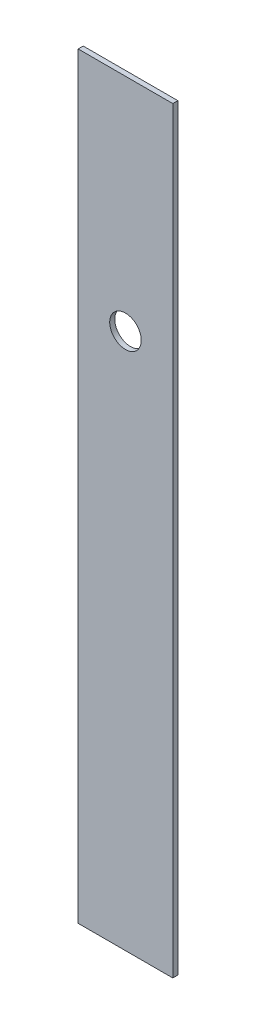
ISO-10303-21;
HEADER;
FILE_DESCRIPTION(('STEP AP214'),'2;1');
FILE_NAME('part.step','',(''),(''),'','','');
FILE_SCHEMA(('AUTOMOTIVE_DESIGN { 1 0 10303 214 1 1 1 1 }'));
ENDSEC;
DATA;
#1=APPLICATION_CONTEXT('core data for automotive mechanical design processes');
#2=APPLICATION_PROTOCOL_DEFINITION('international standard','automotive_design',2000,#1);
#3=PRODUCT_CONTEXT('',#1,'mechanical');
#4=PRODUCT('Part','Part','',(#3));
#5=PRODUCT_RELATED_PRODUCT_CATEGORY('part','',(#4));
#6=PRODUCT_DEFINITION_FORMATION('','',#4);
#7=PRODUCT_DEFINITION_CONTEXT('part definition',#1,'design');
#8=PRODUCT_DEFINITION('design','',#6,#7);
#9=PRODUCT_DEFINITION_SHAPE('','',#8);
#10=(LENGTH_UNIT() NAMED_UNIT(*) SI_UNIT(.MILLI.,.METRE.));
#11=(NAMED_UNIT(*) PLANE_ANGLE_UNIT() SI_UNIT($,.RADIAN.));
#12=(NAMED_UNIT(*) SI_UNIT($,.STERADIAN.) SOLID_ANGLE_UNIT());
#13=UNCERTAINTY_MEASURE_WITH_UNIT(LENGTH_MEASURE(1.E-05),#10,'distance_accuracy_value','');
#14=(GEOMETRIC_REPRESENTATION_CONTEXT(3) GLOBAL_UNCERTAINTY_ASSIGNED_CONTEXT((#13)) GLOBAL_UNIT_ASSIGNED_CONTEXT((#10,
#11,#12)) REPRESENTATION_CONTEXT('',''));
#15=CARTESIAN_POINT('',(0.,0.,0.));
#16=DIRECTION('',(0.,0.,1.));
#17=DIRECTION('',(1.,0.,0.));
#18=AXIS2_PLACEMENT_3D('',#15,#16,#17);
#19=CARTESIAN_POINT('',(-9.525,0.,1.016));
#20=DIRECTION('',(1.,0.,0.));
#21=DIRECTION('',(0.,1.,0.));
#22=AXIS2_PLACEMENT_3D('',#19,#20,#21);
#23=PLANE('',#22);
#24=DIRECTION('',(0.,-1.,0.));
#25=VECTOR('',#24,1.);
#26=CARTESIAN_POINT('',(-9.525,0.,0.));
#27=LINE('',#26,#25);
#28=CARTESIAN_POINT('',(-9.52500000000006,152.4,0.));
#29=VERTEX_POINT('',#28);
#30=CARTESIAN_POINT('',(-9.525,0.,0.));
#31=VERTEX_POINT('',#30);
#32=EDGE_CURVE('E103',#29,#31,#27,.T.);
#33=ORIENTED_EDGE('',*,*,#32,.T.);
#34=DIRECTION('',(0.,0.,-1.));
#35=VECTOR('',#34,1.);
#36=CARTESIAN_POINT('',(-9.525,0.,1.016));
#37=LINE('',#36,#35);
#38=CARTESIAN_POINT('',(-9.525,0.,1.016));
#39=VERTEX_POINT('',#38);
#40=EDGE_CURVE('E11',#39,#31,#37,.T.);
#41=ORIENTED_EDGE('',*,*,#40,.F.);
#42=DIRECTION('',(0.,-1.,0.));
#43=VECTOR('',#42,1.);
#44=CARTESIAN_POINT('',(-9.525,0.,1.016));
#45=LINE('',#44,#43);
#46=CARTESIAN_POINT('',(-9.52500000000006,152.4,1.016));
#47=VERTEX_POINT('',#46);
#48=EDGE_CURVE('E88',#47,#39,#45,.T.);
#49=ORIENTED_EDGE('',*,*,#48,.F.);
#50=DIRECTION('',(0.,0.,-1.));
#51=VECTOR('',#50,1.);
#52=CARTESIAN_POINT('',(-9.52500000000006,152.4,1.016));
#53=LINE('',#52,#51);
#54=EDGE_CURVE('E99',#47,#29,#53,.T.);
#55=ORIENTED_EDGE('',*,*,#54,.T.);
#56=EDGE_LOOP('',(#33,#41,#49,#55));
#57=FACE_BOUND('',#56,.T.);
#58=ADVANCED_FACE('F37',(#57),#23,.F.);
#59=CARTESIAN_POINT('',(-9.525,0.,1.016));
#60=DIRECTION('',(0.,1.,0.));
#61=DIRECTION('',(-1.,0.,0.));
#62=AXIS2_PLACEMENT_3D('',#59,#60,#61);
#63=PLANE('',#62);
#64=DIRECTION('',(1.,0.,0.));
#65=VECTOR('',#64,1.);
#66=CARTESIAN_POINT('',(-9.525,0.,0.));
#67=LINE('',#66,#65);
#68=CARTESIAN_POINT('',(9.525,0.,0.));
#69=VERTEX_POINT('',#68);
#70=EDGE_CURVE('E92',#31,#69,#67,.T.);
#71=ORIENTED_EDGE('',*,*,#70,.T.);
#72=DIRECTION('',(0.,0.,-1.));
#73=VECTOR('',#72,1.);
#74=CARTESIAN_POINT('',(9.525,0.,1.016));
#75=LINE('',#74,#73);
#76=CARTESIAN_POINT('',(9.525,0.,1.016));
#77=VERTEX_POINT('',#76);
#78=EDGE_CURVE('E45',#77,#69,#75,.T.);
#79=ORIENTED_EDGE('',*,*,#78,.F.);
#80=DIRECTION('',(1.,0.,0.));
#81=VECTOR('',#80,1.);
#82=CARTESIAN_POINT('',(-9.525,0.,1.016));
#83=LINE('',#82,#81);
#84=EDGE_CURVE('E83',#39,#77,#83,.T.);
#85=ORIENTED_EDGE('',*,*,#84,.F.);
#86=ORIENTED_EDGE('',*,*,#40,.T.);
#87=EDGE_LOOP('',(#71,#79,#85,#86));
#88=FACE_BOUND('',#87,.T.);
#89=ADVANCED_FACE('F91',(#88),#63,.F.);
#90=CARTESIAN_POINT('',(9.525,0.,1.016));
#91=DIRECTION('',(-1.,0.,0.));
#92=DIRECTION('',(0.,0.,1.));
#93=AXIS2_PLACEMENT_3D('',#90,#91,#92);
#94=PLANE('',#93);
#95=DIRECTION('',(0.,1.,0.));
#96=VECTOR('',#95,1.);
#97=CARTESIAN_POINT('',(9.525,0.,0.));
#98=LINE('',#97,#96);
#99=CARTESIAN_POINT('',(9.525,152.4,0.));
#100=VERTEX_POINT('',#99);
#101=EDGE_CURVE('E70',#69,#100,#98,.T.);
#102=ORIENTED_EDGE('',*,*,#101,.T.);
#103=DIRECTION('',(0.,0.,-1.));
#104=VECTOR('',#103,1.);
#105=CARTESIAN_POINT('',(9.525,152.4,1.016));
#106=LINE('',#105,#104);
#107=CARTESIAN_POINT('',(9.525,152.4,1.016));
#108=VERTEX_POINT('',#107);
#109=EDGE_CURVE('E93',#108,#100,#106,.T.);
#110=ORIENTED_EDGE('',*,*,#109,.F.);
#111=DIRECTION('',(0.,1.,0.));
#112=VECTOR('',#111,1.);
#113=CARTESIAN_POINT('',(9.525,0.,1.016));
#114=LINE('',#113,#112);
#115=EDGE_CURVE('E86',#77,#108,#114,.T.);
#116=ORIENTED_EDGE('',*,*,#115,.F.);
#117=ORIENTED_EDGE('',*,*,#78,.T.);
#118=EDGE_LOOP('',(#102,#110,#116,#117));
#119=FACE_BOUND('',#118,.T.);
#120=ADVANCED_FACE('F94',(#119),#94,.F.);
#121=CARTESIAN_POINT('',(-9.52500000000006,152.4,1.016));
#122=DIRECTION('',(0.,-1.,0.));
#123=DIRECTION('',(0.,0.,-1.));
#124=AXIS2_PLACEMENT_3D('',#121,#122,#123);
#125=PLANE('',#124);
#126=DIRECTION('',(-1.,0.,0.));
#127=VECTOR('',#126,1.);
#128=CARTESIAN_POINT('',(-9.52500000000006,152.4,0.));
#129=LINE('',#128,#127);
#130=EDGE_CURVE('E76',#100,#29,#129,.T.);
#131=ORIENTED_EDGE('',*,*,#130,.T.);
#132=ORIENTED_EDGE('',*,*,#54,.F.);
#133=DIRECTION('',(-1.,0.,0.));
#134=VECTOR('',#133,1.);
#135=CARTESIAN_POINT('',(-9.52500000000006,152.4,1.016));
#136=LINE('',#135,#134);
#137=EDGE_CURVE('E53',#108,#47,#136,.T.);
#138=ORIENTED_EDGE('',*,*,#137,.F.);
#139=ORIENTED_EDGE('',*,*,#109,.T.);
#140=EDGE_LOOP('',(#131,#132,#138,#139));
#141=FACE_BOUND('',#140,.T.);
#142=ADVANCED_FACE('F112',(#141),#125,.F.);
#143=CARTESIAN_POINT('',(0.,0.,1.016));
#144=DIRECTION('',(0.,0.,-1.));
#145=DIRECTION('',(-1.,0.,0.));
#146=AXIS2_PLACEMENT_3D('',#143,#144,#145);
#147=PLANE('',#146);
#148=CARTESIAN_POINT('',(0.,107.95,1.016));
#149=DIRECTION('',(0.,0.,1.));
#150=DIRECTION('',(1.,0.,0.));
#151=AXIS2_PLACEMENT_3D('',#148,#149,#150);
#152=CIRCLE('',#151,3.175);
#153=CARTESIAN_POINT('',(3.175,107.95,1.016));
#154=VERTEX_POINT('',#153);
#155=EDGE_CURVE('E118',#154,#154,#152,.T.);
#156=ORIENTED_EDGE('',*,*,#155,.F.);
#157=EDGE_LOOP('',(#156));
#158=FACE_BOUND('',#157,.T.);
#159=ORIENTED_EDGE('',*,*,#48,.T.);
#160=ORIENTED_EDGE('',*,*,#84,.T.);
#161=ORIENTED_EDGE('',*,*,#115,.T.);
#162=ORIENTED_EDGE('',*,*,#137,.T.);
#163=EDGE_LOOP('',(#159,#160,#161,#162));
#164=FACE_BOUND('',#163,.T.);
#165=ADVANCED_FACE('F84',(#158,#164),#147,.F.);
#166=CARTESIAN_POINT('',(0.,0.,0.));
#167=DIRECTION('',(0.,0.,-1.));
#168=DIRECTION('',(-1.,0.,0.));
#169=AXIS2_PLACEMENT_3D('',#166,#167,#168);
#170=PLANE('',#169);
#171=CARTESIAN_POINT('',(0.,107.95,0.));
#172=DIRECTION('',(0.,0.,1.));
#173=DIRECTION('',(1.,0.,0.));
#174=AXIS2_PLACEMENT_3D('',#171,#172,#173);
#175=CIRCLE('',#174,3.175);
#176=CARTESIAN_POINT('',(3.175,107.95,0.));
#177=VERTEX_POINT('',#176);
#178=EDGE_CURVE('E106',#177,#177,#175,.T.);
#179=ORIENTED_EDGE('',*,*,#178,.T.);
#180=EDGE_LOOP('',(#179));
#181=FACE_BOUND('',#180,.T.);
#182=ORIENTED_EDGE('',*,*,#32,.F.);
#183=ORIENTED_EDGE('',*,*,#130,.F.);
#184=ORIENTED_EDGE('',*,*,#101,.F.);
#185=ORIENTED_EDGE('',*,*,#70,.F.);
#186=EDGE_LOOP('',(#182,#183,#184,#185));
#187=FACE_BOUND('',#186,.T.);
#188=ADVANCED_FACE('F115',(#181,#187),#170,.T.);
#189=CARTESIAN_POINT('',(0.,107.95,0.));
#190=DIRECTION('',(0.,0.,1.));
#191=DIRECTION('',(1.,0.,0.));
#192=AXIS2_PLACEMENT_3D('',#189,#190,#191);
#193=CYLINDRICAL_SURFACE('',#192,3.175);
#194=ORIENTED_EDGE('',*,*,#178,.F.);
#195=EDGE_LOOP('',(#194));
#196=FACE_BOUND('',#195,.T.);
#197=ORIENTED_EDGE('',*,*,#155,.T.);
#198=EDGE_LOOP('',(#197));
#199=FACE_BOUND('',#198,.T.);
#200=ADVANCED_FACE('F127',(#196,#199),#193,.F.);
#201=CLOSED_SHELL('',(#58,#89,#120,#142,#165,#188,#200));
#202=MANIFOLD_SOLID_BREP('B2',#201);
#203=ADVANCED_BREP_SHAPE_REPRESENTATION('',(#18,#202),#14);
#204=SHAPE_DEFINITION_REPRESENTATION(#9,#203);
ENDSEC;
END-ISO-10303-21;
